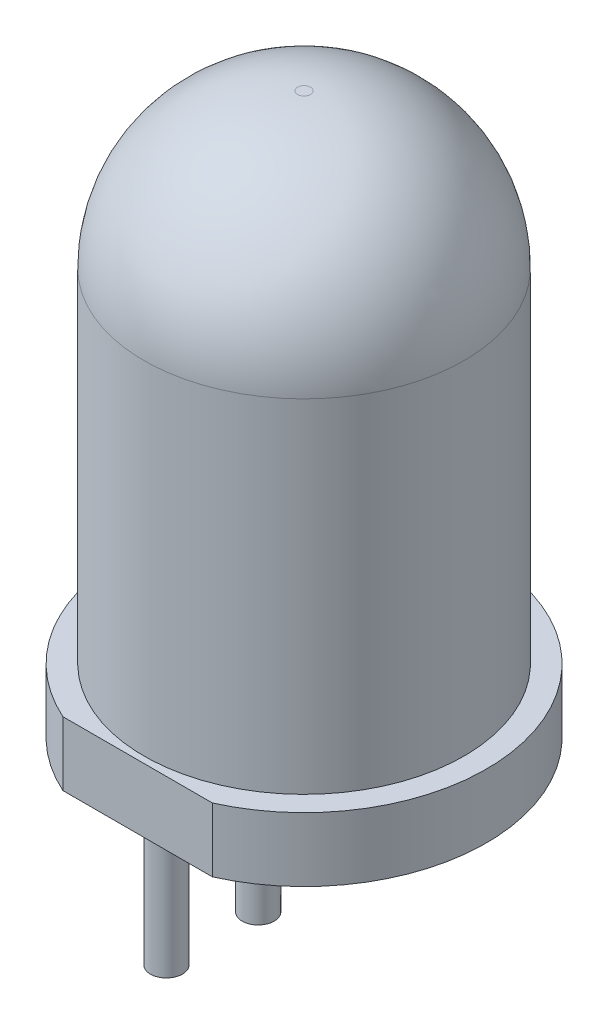
ISO-10303-21;
HEADER;
FILE_DESCRIPTION(('STEP AP214'),'2;1');
FILE_NAME('part.step','',(''),(''),'','','');
FILE_SCHEMA(('AUTOMOTIVE_DESIGN { 1 0 10303 214 1 1 1 1 }'));
ENDSEC;
DATA;
#1=APPLICATION_CONTEXT('core data for automotive mechanical design processes');
#2=APPLICATION_PROTOCOL_DEFINITION('international standard','automotive_design',2000,#1);
#3=PRODUCT_CONTEXT('',#1,'mechanical');
#4=PRODUCT('Part','Part','',(#3));
#5=PRODUCT_RELATED_PRODUCT_CATEGORY('part','',(#4));
#6=PRODUCT_DEFINITION_FORMATION('','',#4);
#7=PRODUCT_DEFINITION_CONTEXT('part definition',#1,'design');
#8=PRODUCT_DEFINITION('design','',#6,#7);
#9=PRODUCT_DEFINITION_SHAPE('','',#8);
#10=(LENGTH_UNIT() NAMED_UNIT(*) SI_UNIT(.MILLI.,.METRE.));
#11=(NAMED_UNIT(*) PLANE_ANGLE_UNIT() SI_UNIT($,.RADIAN.));
#12=(NAMED_UNIT(*) SI_UNIT($,.STERADIAN.) SOLID_ANGLE_UNIT());
#13=UNCERTAINTY_MEASURE_WITH_UNIT(LENGTH_MEASURE(1.E-05),#10,'distance_accuracy_value','');
#14=(GEOMETRIC_REPRESENTATION_CONTEXT(3) GLOBAL_UNCERTAINTY_ASSIGNED_CONTEXT((#13)) GLOBAL_UNIT_ASSIGNED_CONTEXT((#10,
#11,#12)) REPRESENTATION_CONTEXT('',''));
#15=CARTESIAN_POINT('',(0.,0.,0.));
#16=DIRECTION('',(0.,0.,1.));
#17=DIRECTION('',(1.,0.,0.));
#18=AXIS2_PLACEMENT_3D('',#15,#16,#17);
#19=CARTESIAN_POINT('',(0.,0.,0.));
#20=DIRECTION('',(0.,-1.,0.));
#21=DIRECTION('',(0.,0.,-1.));
#22=AXIS2_PLACEMENT_3D('',#19,#20,#21);
#23=PLANE('',#22);
#24=CARTESIAN_POINT('',(0.,0.,0.716666666666667));
#25=DIRECTION('',(0.,-1.,0.));
#26=DIRECTION('',(0.,0.,-1.));
#27=AXIS2_PLACEMENT_3D('',#24,#25,#26);
#28=CIRCLE('',#27,0.25);
#29=CARTESIAN_POINT('',(0.,0.,0.466666666666667));
#30=VERTEX_POINT('',#29);
#31=EDGE_CURVE('E103',#30,#30,#28,.T.);
#32=ORIENTED_EDGE('',*,*,#31,.F.);
#33=EDGE_LOOP('',(#32));
#34=FACE_BOUND('',#33,.T.);
#35=CARTESIAN_POINT('',(0.,0.,-0.716666666666667));
#36=DIRECTION('',(0.,-1.,0.));
#37=DIRECTION('',(0.,0.,-1.));
#38=AXIS2_PLACEMENT_3D('',#35,#36,#37);
#39=CIRCLE('',#38,0.25);
#40=CARTESIAN_POINT('',(0.,0.,-0.966666666666667));
#41=VERTEX_POINT('',#40);
#42=EDGE_CURVE('E97',#41,#41,#39,.T.);
#43=ORIENTED_EDGE('',*,*,#42,.F.);
#44=EDGE_LOOP('',(#43));
#45=FACE_BOUND('',#44,.T.);
#46=CARTESIAN_POINT('',(0.,0.,2.15));
#47=DIRECTION('',(0.,-1.,0.));
#48=DIRECTION('',(0.,0.,-1.));
#49=AXIS2_PLACEMENT_3D('',#46,#47,#48);
#50=CIRCLE('',#49,0.25);
#51=CARTESIAN_POINT('',(0.,0.,1.9));
#52=VERTEX_POINT('',#51);
#53=EDGE_CURVE('E91',#52,#52,#50,.T.);
#54=ORIENTED_EDGE('',*,*,#53,.F.);
#55=EDGE_LOOP('',(#54));
#56=FACE_BOUND('',#55,.T.);
#57=CARTESIAN_POINT('',(0.,0.,-2.15));
#58=DIRECTION('',(0.,-1.,0.));
#59=DIRECTION('',(0.,0.,-1.));
#60=AXIS2_PLACEMENT_3D('',#57,#58,#59);
#61=CIRCLE('',#60,0.25);
#62=CARTESIAN_POINT('',(0.,0.,-2.4));
#63=VERTEX_POINT('',#62);
#64=EDGE_CURVE('E85',#63,#63,#61,.T.);
#65=ORIENTED_EDGE('',*,*,#64,.F.);
#66=EDGE_LOOP('',(#65));
#67=FACE_BOUND('',#66,.T.);
#68=DIRECTION('',(1.,0.,0.));
#69=VECTOR('',#68,1.);
#70=CARTESIAN_POINT('',(-1.16726175299288,0.,2.6));
#71=LINE('',#70,#69);
#72=CARTESIAN_POINT('',(-1.16726175299288,0.,2.6));
#73=VERTEX_POINT('',#72);
#74=CARTESIAN_POINT('',(1.16726175299288,0.,2.6));
#75=VERTEX_POINT('',#74);
#76=EDGE_CURVE('E64',#73,#75,#71,.T.);
#77=ORIENTED_EDGE('',*,*,#76,.F.);
#78=CARTESIAN_POINT('',(0.,0.,0.));
#79=DIRECTION('',(0.,-1.,0.));
#80=DIRECTION('',(0.,0.,-1.));
#81=AXIS2_PLACEMENT_3D('',#78,#79,#80);
#82=CIRCLE('',#81,2.85);
#83=EDGE_CURVE('E11',#73,#75,#82,.T.);
#84=ORIENTED_EDGE('',*,*,#83,.T.);
#85=EDGE_LOOP('',(#77,#84));
#86=FACE_BOUND('',#85,.T.);
#87=ADVANCED_FACE('F35',(#34,#45,#56,#67,#86),#23,.T.);
#88=CARTESIAN_POINT('',(0.,0.,0.));
#89=DIRECTION('',(0.,-1.,0.));
#90=DIRECTION('',(0.,0.,-1.));
#91=AXIS2_PLACEMENT_3D('',#88,#89,#90);
#92=CYLINDRICAL_SURFACE('',#91,2.85);
#93=DIRECTION('',(0.,-1.,0.));
#94=VECTOR('',#93,1.);
#95=CARTESIAN_POINT('',(1.16726175299288,3.34787137637478,2.6));
#96=LINE('',#95,#94);
#97=CARTESIAN_POINT('',(1.16726175299288,1.,2.6));
#98=VERTEX_POINT('',#97);
#99=EDGE_CURVE('E49',#98,#75,#96,.T.);
#100=ORIENTED_EDGE('',*,*,#99,.T.);
#101=ORIENTED_EDGE('',*,*,#83,.F.);
#102=DIRECTION('',(0.,-1.,0.));
#103=VECTOR('',#102,1.);
#104=CARTESIAN_POINT('',(-1.16726175299288,3.34787137637478,2.6));
#105=LINE('',#104,#103);
#106=CARTESIAN_POINT('',(-1.16726175299288,1.,2.6));
#107=VERTEX_POINT('',#106);
#108=EDGE_CURVE('E55',#107,#73,#105,.T.);
#109=ORIENTED_EDGE('',*,*,#108,.F.);
#110=CARTESIAN_POINT('',(0.,1.,0.));
#111=DIRECTION('',(0.,-1.,0.));
#112=DIRECTION('',(0.,0.,-1.));
#113=AXIS2_PLACEMENT_3D('',#110,#111,#112);
#114=CIRCLE('',#113,2.85);
#115=EDGE_CURVE('E42',#107,#98,#114,.T.);
#116=ORIENTED_EDGE('',*,*,#115,.T.);
#117=EDGE_LOOP('',(#100,#101,#109,#116));
#118=FACE_BOUND('',#117,.T.);
#119=ADVANCED_FACE('F68',(#118),#92,.T.);
#120=CARTESIAN_POINT('',(2.85,1.,0.));
#121=DIRECTION('',(0.,1.,0.));
#122=DIRECTION('',(0.,0.,1.));
#123=AXIS2_PLACEMENT_3D('',#120,#121,#122);
#124=PLANE('',#123);
#125=DIRECTION('',(1.,0.,0.));
#126=VECTOR('',#125,1.);
#127=CARTESIAN_POINT('',(-1.16726175299288,1.,2.6));
#128=LINE('',#127,#126);
#129=EDGE_CURVE('E59',#107,#98,#128,.T.);
#130=ORIENTED_EDGE('',*,*,#129,.T.);
#131=ORIENTED_EDGE('',*,*,#115,.F.);
#132=EDGE_LOOP('',(#130,#131));
#133=FACE_BOUND('',#132,.T.);
#134=CARTESIAN_POINT('',(0.,1.,0.));
#135=DIRECTION('',(0.,-1.,0.));
#136=DIRECTION('',(0.,0.,-1.));
#137=AXIS2_PLACEMENT_3D('',#134,#135,#136);
#138=CIRCLE('',#137,2.5);
#139=CARTESIAN_POINT('',(0.,1.,-2.5));
#140=VERTEX_POINT('',#139);
#141=EDGE_CURVE('E73',#140,#140,#138,.T.);
#142=ORIENTED_EDGE('',*,*,#141,.T.);
#143=EDGE_LOOP('',(#142));
#144=FACE_BOUND('',#143,.T.);
#145=ADVANCED_FACE('F71',(#133,#144),#124,.T.);
#146=CARTESIAN_POINT('',(0.,0.,0.));
#147=DIRECTION('',(0.,-1.,0.));
#148=DIRECTION('',(0.,0.,-1.));
#149=AXIS2_PLACEMENT_3D('',#146,#147,#148);
#150=CYLINDRICAL_SURFACE('',#149,2.5);
#151=CARTESIAN_POINT('',(0.,6.35,0.));
#152=DIRECTION('',(0.,-1.,0.));
#153=DIRECTION('',(0.,0.,-1.));
#154=AXIS2_PLACEMENT_3D('',#151,#152,#153);
#155=CIRCLE('',#154,2.5);
#156=CARTESIAN_POINT('',(0.,6.35,-2.5));
#157=VERTEX_POINT('',#156);
#158=EDGE_CURVE('E75',#157,#157,#155,.T.);
#159=ORIENTED_EDGE('',*,*,#158,.T.);
#160=EDGE_LOOP('',(#159));
#161=FACE_BOUND('',#160,.T.);
#162=ORIENTED_EDGE('',*,*,#141,.F.);
#163=EDGE_LOOP('',(#162));
#164=FACE_BOUND('',#163,.T.);
#165=ADVANCED_FACE('F150',(#161,#164),#150,.T.);
#166=CARTESIAN_POINT('',(0.,6.35,0.));
#167=DIRECTION('',(0.,-1.,0.));
#168=DIRECTION('',(0.,0.,-1.));
#169=AXIS2_PLACEMENT_3D('',#166,#167,#168);
#170=DEGENERATE_TOROIDAL_SURFACE('',#169,0.1,2.4,.T.);
#171=CARTESIAN_POINT('',(0.,8.75,0.));
#172=DIRECTION('',(0.,-1.,0.));
#173=DIRECTION('',(0.,0.,-1.));
#174=AXIS2_PLACEMENT_3D('',#171,#172,#173);
#175=CIRCLE('',#174,0.1);
#176=CARTESIAN_POINT('',(0.,8.75,-0.1));
#177=VERTEX_POINT('',#176);
#178=EDGE_CURVE('E69',#177,#177,#175,.T.);
#179=ORIENTED_EDGE('',*,*,#178,.T.);
#180=EDGE_LOOP('',(#179));
#181=FACE_BOUND('',#180,.T.);
#182=ORIENTED_EDGE('',*,*,#158,.F.);
#183=EDGE_LOOP('',(#182));
#184=FACE_BOUND('',#183,.T.);
#185=ADVANCED_FACE('F146',(#181,#184),#170,.T.);
#186=CARTESIAN_POINT('',(0.,8.75,0.));
#187=DIRECTION('',(0.,1.,0.));
#188=DIRECTION('',(0.,0.,1.));
#189=AXIS2_PLACEMENT_3D('',#186,#187,#188);
#190=PLANE('',#189);
#191=ORIENTED_EDGE('',*,*,#178,.F.);
#192=EDGE_LOOP('',(#191));
#193=FACE_BOUND('',#192,.T.);
#194=ADVANCED_FACE('F139',(#193),#190,.T.);
#195=CARTESIAN_POINT('',(-1.16726175299288,3.34787137637478,2.6));
#196=DIRECTION('',(0.,0.,-1.));
#197=DIRECTION('',(-1.,0.,0.));
#198=AXIS2_PLACEMENT_3D('',#195,#196,#197);
#199=PLANE('',#198);
#200=ORIENTED_EDGE('',*,*,#108,.T.);
#201=ORIENTED_EDGE('',*,*,#76,.T.);
#202=ORIENTED_EDGE('',*,*,#99,.F.);
#203=ORIENTED_EDGE('',*,*,#129,.F.);
#204=EDGE_LOOP('',(#200,#201,#202,#203));
#205=FACE_BOUND('',#204,.T.);
#206=ADVANCED_FACE('F60',(#205),#199,.F.);
#207=CARTESIAN_POINT('',(0.,-2.,-2.15));
#208=DIRECTION('',(0.,1.,0.));
#209=DIRECTION('',(0.,0.,1.));
#210=AXIS2_PLACEMENT_3D('',#207,#208,#209);
#211=CYLINDRICAL_SURFACE('',#210,0.25);
#212=CARTESIAN_POINT('',(0.,-2.,-2.15));
#213=DIRECTION('',(0.,-1.,0.));
#214=DIRECTION('',(0.,0.,-1.));
#215=AXIS2_PLACEMENT_3D('',#212,#213,#214);
#216=CIRCLE('',#215,0.25);
#217=CARTESIAN_POINT('',(0.,-2.,-2.4));
#218=VERTEX_POINT('',#217);
#219=EDGE_CURVE('E84',#218,#218,#216,.T.);
#220=ORIENTED_EDGE('',*,*,#219,.F.);
#221=EDGE_LOOP('',(#220));
#222=FACE_BOUND('',#221,.T.);
#223=ORIENTED_EDGE('',*,*,#64,.T.);
#224=EDGE_LOOP('',(#223));
#225=FACE_BOUND('',#224,.T.);
#226=ADVANCED_FACE('F127',(#222,#225),#211,.T.);
#227=CARTESIAN_POINT('',(0.,-2.,-2.15));
#228=DIRECTION('',(0.,-1.,0.));
#229=DIRECTION('',(0.,0.,-1.));
#230=AXIS2_PLACEMENT_3D('',#227,#228,#229);
#231=PLANE('',#230);
#232=ORIENTED_EDGE('',*,*,#219,.T.);
#233=EDGE_LOOP('',(#232));
#234=FACE_BOUND('',#233,.T.);
#235=ADVANCED_FACE('F129',(#234),#231,.T.);
#236=CARTESIAN_POINT('',(0.,-2.,2.15));
#237=DIRECTION('',(0.,1.,0.));
#238=DIRECTION('',(0.,0.,1.));
#239=AXIS2_PLACEMENT_3D('',#236,#237,#238);
#240=CYLINDRICAL_SURFACE('',#239,0.25);
#241=CARTESIAN_POINT('',(0.,-2.,2.15));
#242=DIRECTION('',(0.,-1.,0.));
#243=DIRECTION('',(0.,0.,-1.));
#244=AXIS2_PLACEMENT_3D('',#241,#242,#243);
#245=CIRCLE('',#244,0.25);
#246=CARTESIAN_POINT('',(0.,-2.,1.9));
#247=VERTEX_POINT('',#246);
#248=EDGE_CURVE('E88',#247,#247,#245,.T.);
#249=ORIENTED_EDGE('',*,*,#248,.F.);
#250=EDGE_LOOP('',(#249));
#251=FACE_BOUND('',#250,.T.);
#252=ORIENTED_EDGE('',*,*,#53,.T.);
#253=EDGE_LOOP('',(#252));
#254=FACE_BOUND('',#253,.T.);
#255=ADVANCED_FACE('F136',(#251,#254),#240,.T.);
#256=CARTESIAN_POINT('',(0.,-2.,2.15));
#257=DIRECTION('',(0.,-1.,0.));
#258=DIRECTION('',(0.,0.,-1.));
#259=AXIS2_PLACEMENT_3D('',#256,#257,#258);
#260=PLANE('',#259);
#261=ORIENTED_EDGE('',*,*,#248,.T.);
#262=EDGE_LOOP('',(#261));
#263=FACE_BOUND('',#262,.T.);
#264=ADVANCED_FACE('F204',(#263),#260,.T.);
#265=CARTESIAN_POINT('',(0.,-2.,-0.716666666666667));
#266=DIRECTION('',(0.,1.,0.));
#267=DIRECTION('',(0.,0.,1.));
#268=AXIS2_PLACEMENT_3D('',#265,#266,#267);
#269=CYLINDRICAL_SURFACE('',#268,0.25);
#270=CARTESIAN_POINT('',(0.,-2.,-0.716666666666667));
#271=DIRECTION('',(0.,-1.,0.));
#272=DIRECTION('',(0.,0.,-1.));
#273=AXIS2_PLACEMENT_3D('',#270,#271,#272);
#274=CIRCLE('',#273,0.25);
#275=CARTESIAN_POINT('',(0.,-2.,-0.966666666666667));
#276=VERTEX_POINT('',#275);
#277=EDGE_CURVE('E94',#276,#276,#274,.T.);
#278=ORIENTED_EDGE('',*,*,#277,.F.);
#279=EDGE_LOOP('',(#278));
#280=FACE_BOUND('',#279,.T.);
#281=ORIENTED_EDGE('',*,*,#42,.T.);
#282=EDGE_LOOP('',(#281));
#283=FACE_BOUND('',#282,.T.);
#284=ADVANCED_FACE('F213',(#280,#283),#269,.T.);
#285=CARTESIAN_POINT('',(0.,-2.,-0.716666666666667));
#286=DIRECTION('',(0.,-1.,0.));
#287=DIRECTION('',(0.,0.,-1.));
#288=AXIS2_PLACEMENT_3D('',#285,#286,#287);
#289=PLANE('',#288);
#290=ORIENTED_EDGE('',*,*,#277,.T.);
#291=EDGE_LOOP('',(#290));
#292=FACE_BOUND('',#291,.T.);
#293=ADVANCED_FACE('F114',(#292),#289,.T.);
#294=CARTESIAN_POINT('',(0.,-2.,0.716666666666667));
#295=DIRECTION('',(0.,1.,0.));
#296=DIRECTION('',(0.,0.,1.));
#297=AXIS2_PLACEMENT_3D('',#294,#295,#296);
#298=CYLINDRICAL_SURFACE('',#297,0.25);
#299=CARTESIAN_POINT('',(0.,-2.,0.716666666666667));
#300=DIRECTION('',(0.,-1.,0.));
#301=DIRECTION('',(0.,0.,-1.));
#302=AXIS2_PLACEMENT_3D('',#299,#300,#301);
#303=CIRCLE('',#302,0.25);
#304=CARTESIAN_POINT('',(0.,-2.,0.466666666666667));
#305=VERTEX_POINT('',#304);
#306=EDGE_CURVE('E100',#305,#305,#303,.T.);
#307=ORIENTED_EDGE('',*,*,#306,.F.);
#308=EDGE_LOOP('',(#307));
#309=FACE_BOUND('',#308,.T.);
#310=ORIENTED_EDGE('',*,*,#31,.T.);
#311=EDGE_LOOP('',(#310));
#312=FACE_BOUND('',#311,.T.);
#313=ADVANCED_FACE('F111',(#309,#312),#298,.T.);
#314=CARTESIAN_POINT('',(0.,-2.,0.716666666666667));
#315=DIRECTION('',(0.,-1.,0.));
#316=DIRECTION('',(0.,0.,-1.));
#317=AXIS2_PLACEMENT_3D('',#314,#315,#316);
#318=PLANE('',#317);
#319=ORIENTED_EDGE('',*,*,#306,.T.);
#320=EDGE_LOOP('',(#319));
#321=FACE_BOUND('',#320,.T.);
#322=ADVANCED_FACE('F109',(#321),#318,.T.);
#323=CLOSED_SHELL('',(#87,#119,#145,#165,#185,#194,#206,#226,#235,#255,#264,#284,#293,#313,#322));
#324=MANIFOLD_SOLID_BREP('B2',#323);
#325=ADVANCED_BREP_SHAPE_REPRESENTATION('',(#18,#324),#14);
#326=SHAPE_DEFINITION_REPRESENTATION(#9,#325);
ENDSEC;
END-ISO-10303-21;
